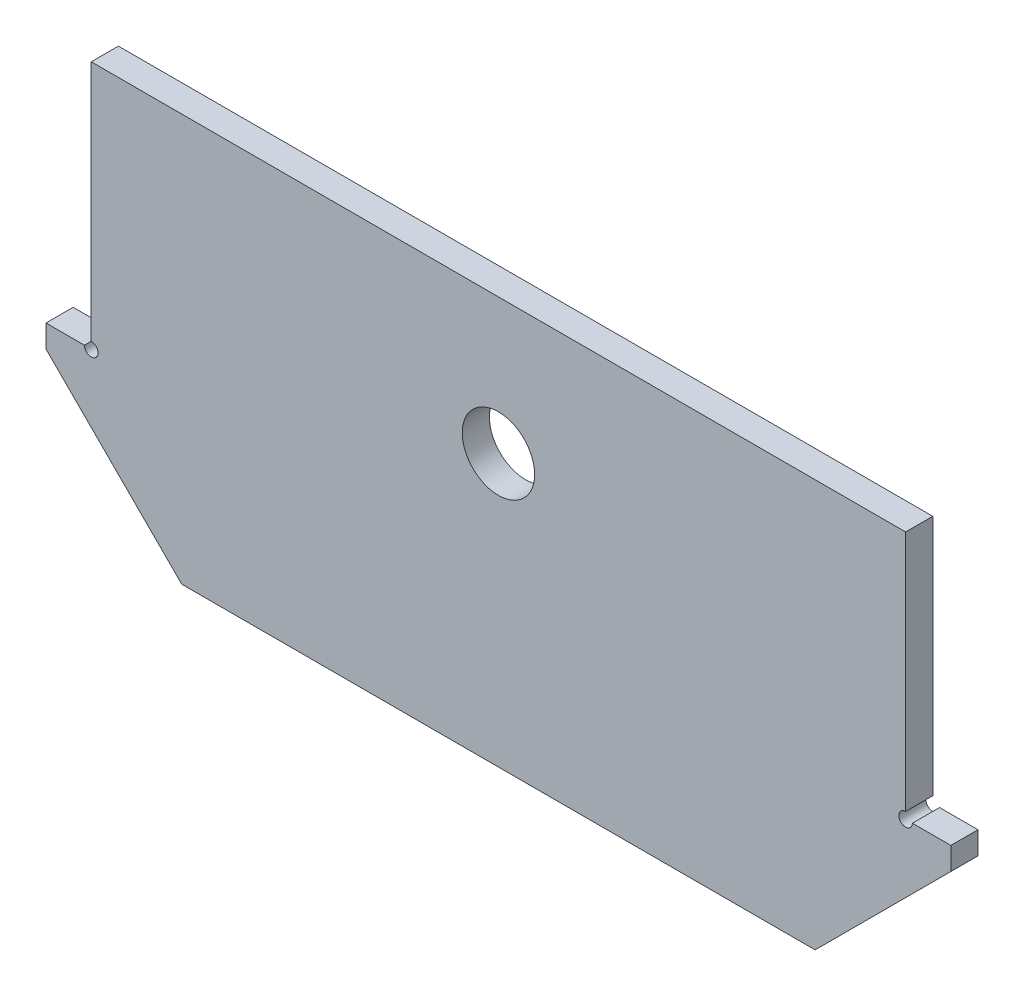
ISO-10303-21;
HEADER;
FILE_DESCRIPTION(('STEP AP214'),'2;1');
FILE_NAME('part.step','',(''),(''),'','','');
FILE_SCHEMA(('AUTOMOTIVE_DESIGN { 1 0 10303 214 1 1 1 1 }'));
ENDSEC;
DATA;
#1=APPLICATION_CONTEXT('core data for automotive mechanical design processes');
#2=APPLICATION_PROTOCOL_DEFINITION('international standard','automotive_design',2000,#1);
#3=PRODUCT_CONTEXT('',#1,'mechanical');
#4=PRODUCT('Part','Part','',(#3));
#5=PRODUCT_RELATED_PRODUCT_CATEGORY('part','',(#4));
#6=PRODUCT_DEFINITION_FORMATION('','',#4);
#7=PRODUCT_DEFINITION_CONTEXT('part definition',#1,'design');
#8=PRODUCT_DEFINITION('design','',#6,#7);
#9=PRODUCT_DEFINITION_SHAPE('','',#8);
#10=(LENGTH_UNIT() NAMED_UNIT(*) SI_UNIT(.MILLI.,.METRE.));
#11=(NAMED_UNIT(*) PLANE_ANGLE_UNIT() SI_UNIT($,.RADIAN.));
#12=(NAMED_UNIT(*) SI_UNIT($,.STERADIAN.) SOLID_ANGLE_UNIT());
#13=UNCERTAINTY_MEASURE_WITH_UNIT(LENGTH_MEASURE(1.E-05),#10,'distance_accuracy_value','');
#14=(GEOMETRIC_REPRESENTATION_CONTEXT(3) GLOBAL_UNCERTAINTY_ASSIGNED_CONTEXT((#13)) GLOBAL_UNIT_ASSIGNED_CONTEXT((#10,
#11,#12)) REPRESENTATION_CONTEXT('',''));
#15=CARTESIAN_POINT('',(0.,0.,0.));
#16=DIRECTION('',(0.,0.,1.));
#17=DIRECTION('',(1.,0.,0.));
#18=AXIS2_PLACEMENT_3D('',#15,#16,#17);
#19=CARTESIAN_POINT('',(-99.9999999999998,-1414.00000592193,-3.));
#20=DIRECTION('',(0.,1.,0.));
#21=DIRECTION('',(0.,0.,1.));
#22=AXIS2_PLACEMENT_3D('',#19,#20,#21);
#23=PLANE('',#22);
#24=DIRECTION('',(0.,0.,1.));
#25=VECTOR('',#24,1.);
#26=CARTESIAN_POINT('',(-91.4999999999999,-1414.00000592193,-3.));
#27=LINE('',#26,#25);
#28=CARTESIAN_POINT('',(-91.4999999999999,-1414.00000592193,-3.));
#29=VERTEX_POINT('',#28);
#30=CARTESIAN_POINT('',(-91.4999999999999,-1414.00000592193,3.));
#31=VERTEX_POINT('',#30);
#32=EDGE_CURVE('E54',#29,#31,#27,.T.);
#33=ORIENTED_EDGE('',*,*,#32,.F.);
#34=DIRECTION('',(-1.,0.,0.));
#35=VECTOR('',#34,1.);
#36=CARTESIAN_POINT('',(-99.9999999999998,-1414.00000592193,-3.));
#37=LINE('',#36,#35);
#38=CARTESIAN_POINT('',(-99.9999999999998,-1414.00000592193,-3.));
#39=VERTEX_POINT('',#38);
#40=EDGE_CURVE('E211',#29,#39,#37,.T.);
#41=ORIENTED_EDGE('',*,*,#40,.T.);
#42=DIRECTION('',(0.,0.,1.));
#43=VECTOR('',#42,1.);
#44=CARTESIAN_POINT('',(-99.9999999999998,-1414.00000592193,-3.));
#45=LINE('',#44,#43);
#46=CARTESIAN_POINT('',(-99.9999999999998,-1414.00000592193,3.));
#47=VERTEX_POINT('',#46);
#48=EDGE_CURVE('E154',#39,#47,#45,.T.);
#49=ORIENTED_EDGE('',*,*,#48,.T.);
#50=DIRECTION('',(-1.,0.,0.));
#51=VECTOR('',#50,1.);
#52=CARTESIAN_POINT('',(-99.9999999999998,-1414.00000592193,3.));
#53=LINE('',#52,#51);
#54=EDGE_CURVE('E173',#31,#47,#53,.T.);
#55=ORIENTED_EDGE('',*,*,#54,.F.);
#56=EDGE_LOOP('',(#33,#41,#49,#55));
#57=FACE_BOUND('',#56,.T.);
#58=ADVANCED_FACE('F33',(#57),#23,.T.);
#59=CARTESIAN_POINT('',(-90.,-1414.00000592193,-3.));
#60=DIRECTION('',(-1.,0.,0.));
#61=DIRECTION('',(0.,0.,1.));
#62=AXIS2_PLACEMENT_3D('',#59,#60,#61);
#63=PLANE('',#62);
#64=DIRECTION('',(0.,0.,1.));
#65=VECTOR('',#64,1.);
#66=CARTESIAN_POINT('',(-90.,-1412.50000592193,-3.));
#67=LINE('',#66,#65);
#68=CARTESIAN_POINT('',(-90.,-1412.50000592193,3.));
#69=VERTEX_POINT('',#68);
#70=CARTESIAN_POINT('',(-90.,-1412.50000592193,-3.));
#71=VERTEX_POINT('',#70);
#72=EDGE_CURVE('E183',#69,#71,#67,.F.);
#73=ORIENTED_EDGE('',*,*,#72,.F.);
#74=DIRECTION('',(0.,-1.,0.));
#75=VECTOR('',#74,1.);
#76=CARTESIAN_POINT('',(-90.,-1414.00000592193,3.));
#77=LINE('',#76,#75);
#78=CARTESIAN_POINT('',(-90.,-1359.00000592193,3.));
#79=VERTEX_POINT('',#78);
#80=EDGE_CURVE('E208',#79,#69,#77,.T.);
#81=ORIENTED_EDGE('',*,*,#80,.F.);
#82=DIRECTION('',(0.,0.,1.));
#83=VECTOR('',#82,1.);
#84=CARTESIAN_POINT('',(-90.,-1359.00000592193,-3.));
#85=LINE('',#84,#83);
#86=CARTESIAN_POINT('',(-90.,-1359.00000592193,-3.));
#87=VERTEX_POINT('',#86);
#88=EDGE_CURVE('E155',#87,#79,#85,.T.);
#89=ORIENTED_EDGE('',*,*,#88,.F.);
#90=DIRECTION('',(0.,-1.,0.));
#91=VECTOR('',#90,1.);
#92=CARTESIAN_POINT('',(-90.,-1414.00000592193,-3.));
#93=LINE('',#92,#91);
#94=EDGE_CURVE('E151',#87,#71,#93,.T.);
#95=ORIENTED_EDGE('',*,*,#94,.T.);
#96=EDGE_LOOP('',(#73,#81,#89,#95));
#97=FACE_BOUND('',#96,.T.);
#98=ADVANCED_FACE('F247',(#97),#63,.T.);
#99=CARTESIAN_POINT('',(-90.,-1359.00000592193,-3.));
#100=DIRECTION('',(0.,1.,0.));
#101=DIRECTION('',(0.,0.,1.));
#102=AXIS2_PLACEMENT_3D('',#99,#100,#101);
#103=PLANE('',#102);
#104=ORIENTED_EDGE('',*,*,#88,.T.);
#105=DIRECTION('',(-1.,0.,0.));
#106=VECTOR('',#105,1.);
#107=CARTESIAN_POINT('',(-90.,-1359.00000592193,3.));
#108=LINE('',#107,#106);
#109=CARTESIAN_POINT('',(90.0000000000003,-1359.00000592193,3.));
#110=VERTEX_POINT('',#109);
#111=EDGE_CURVE('E205',#110,#79,#108,.T.);
#112=ORIENTED_EDGE('',*,*,#111,.F.);
#113=DIRECTION('',(0.,0.,1.));
#114=VECTOR('',#113,1.);
#115=CARTESIAN_POINT('',(90.0000000000003,-1359.00000592193,-3.));
#116=LINE('',#115,#114);
#117=CARTESIAN_POINT('',(90.0000000000003,-1359.00000592193,-3.));
#118=VERTEX_POINT('',#117);
#119=EDGE_CURVE('E157',#118,#110,#116,.T.);
#120=ORIENTED_EDGE('',*,*,#119,.F.);
#121=DIRECTION('',(-1.,0.,0.));
#122=VECTOR('',#121,1.);
#123=CARTESIAN_POINT('',(-90.,-1359.00000592193,-3.));
#124=LINE('',#123,#122);
#125=EDGE_CURVE('E143',#118,#87,#124,.T.);
#126=ORIENTED_EDGE('',*,*,#125,.T.);
#127=EDGE_LOOP('',(#104,#112,#120,#126));
#128=FACE_BOUND('',#127,.T.);
#129=ADVANCED_FACE('F251',(#128),#103,.T.);
#130=CARTESIAN_POINT('',(90.0000000000003,-1414.00000592193,-3.));
#131=DIRECTION('',(1.,0.,0.));
#132=DIRECTION('',(0.,0.,-1.));
#133=AXIS2_PLACEMENT_3D('',#130,#131,#132);
#134=PLANE('',#133);
#135=DIRECTION('',(0.,0.,1.));
#136=VECTOR('',#135,1.);
#137=CARTESIAN_POINT('',(90.0000000000003,-1412.50000592193,-3.));
#138=LINE('',#137,#136);
#139=CARTESIAN_POINT('',(90.0000000000003,-1412.50000592193,-3.));
#140=VERTEX_POINT('',#139);
#141=CARTESIAN_POINT('',(90.0000000000003,-1412.50000592193,3.));
#142=VERTEX_POINT('',#141);
#143=EDGE_CURVE('E47',#140,#142,#138,.T.);
#144=ORIENTED_EDGE('',*,*,#143,.F.);
#145=DIRECTION('',(0.,1.,0.));
#146=VECTOR('',#145,1.);
#147=CARTESIAN_POINT('',(90.0000000000003,-1414.00000592193,-3.));
#148=LINE('',#147,#146);
#149=EDGE_CURVE('E137',#140,#118,#148,.T.);
#150=ORIENTED_EDGE('',*,*,#149,.T.);
#151=ORIENTED_EDGE('',*,*,#119,.T.);
#152=DIRECTION('',(0.,1.,0.));
#153=VECTOR('',#152,1.);
#154=CARTESIAN_POINT('',(90.0000000000003,-1414.00000592193,3.));
#155=LINE('',#154,#153);
#156=EDGE_CURVE('E203',#142,#110,#155,.T.);
#157=ORIENTED_EDGE('',*,*,#156,.F.);
#158=EDGE_LOOP('',(#144,#150,#151,#157));
#159=FACE_BOUND('',#158,.T.);
#160=ADVANCED_FACE('F257',(#159),#134,.T.);
#161=CARTESIAN_POINT('',(90.0000000000003,-1414.00000592193,-3.));
#162=DIRECTION('',(0.,1.,0.));
#163=DIRECTION('',(0.,0.,1.));
#164=AXIS2_PLACEMENT_3D('',#161,#162,#163);
#165=PLANE('',#164);
#166=DIRECTION('',(0.,0.,1.));
#167=VECTOR('',#166,1.);
#168=CARTESIAN_POINT('',(91.5000000000002,-1414.00000592193,-3.));
#169=LINE('',#168,#167);
#170=CARTESIAN_POINT('',(91.5000000000002,-1414.00000592193,3.));
#171=VERTEX_POINT('',#170);
#172=CARTESIAN_POINT('',(91.5000000000002,-1414.00000592193,-3.));
#173=VERTEX_POINT('',#172);
#174=EDGE_CURVE('E118',#171,#173,#169,.F.);
#175=ORIENTED_EDGE('',*,*,#174,.F.);
#176=DIRECTION('',(-1.,0.,0.));
#177=VECTOR('',#176,1.);
#178=CARTESIAN_POINT('',(90.0000000000003,-1414.00000592193,3.));
#179=LINE('',#178,#177);
#180=CARTESIAN_POINT('',(100.,-1414.00000592193,3.));
#181=VERTEX_POINT('',#180);
#182=EDGE_CURVE('E201',#181,#171,#179,.T.);
#183=ORIENTED_EDGE('',*,*,#182,.F.);
#184=DIRECTION('',(0.,0.,1.));
#185=VECTOR('',#184,1.);
#186=CARTESIAN_POINT('',(100.,-1414.00000592193,-3.));
#187=LINE('',#186,#185);
#188=CARTESIAN_POINT('',(100.,-1414.00000592193,-3.));
#189=VERTEX_POINT('',#188);
#190=EDGE_CURVE('E140',#189,#181,#187,.T.);
#191=ORIENTED_EDGE('',*,*,#190,.F.);
#192=DIRECTION('',(-1.,0.,0.));
#193=VECTOR('',#192,1.);
#194=CARTESIAN_POINT('',(90.0000000000003,-1414.00000592193,-3.));
#195=LINE('',#194,#193);
#196=EDGE_CURVE('E134',#189,#173,#195,.T.);
#197=ORIENTED_EDGE('',*,*,#196,.T.);
#198=EDGE_LOOP('',(#175,#183,#191,#197));
#199=FACE_BOUND('',#198,.T.);
#200=ADVANCED_FACE('F139',(#199),#165,.T.);
#201=CARTESIAN_POINT('',(100.,-1414.00000592193,-3.));
#202=DIRECTION('',(1.,0.,0.));
#203=DIRECTION('',(0.,1.,0.));
#204=AXIS2_PLACEMENT_3D('',#201,#202,#203);
#205=PLANE('',#204);
#206=ORIENTED_EDGE('',*,*,#190,.T.);
#207=DIRECTION('',(0.,1.,0.));
#208=VECTOR('',#207,1.);
#209=CARTESIAN_POINT('',(100.,-1414.00000592193,3.));
#210=LINE('',#209,#208);
#211=CARTESIAN_POINT('',(100.,-1419.00000592193,3.));
#212=VERTEX_POINT('',#211);
#213=EDGE_CURVE('E198',#212,#181,#210,.T.);
#214=ORIENTED_EDGE('',*,*,#213,.F.);
#215=DIRECTION('',(0.,0.,1.));
#216=VECTOR('',#215,1.);
#217=CARTESIAN_POINT('',(100.,-1419.00000592193,-3.));
#218=LINE('',#217,#216);
#219=CARTESIAN_POINT('',(100.,-1419.00000592193,-3.));
#220=VERTEX_POINT('',#219);
#221=EDGE_CURVE('E161',#220,#212,#218,.T.);
#222=ORIENTED_EDGE('',*,*,#221,.F.);
#223=DIRECTION('',(0.,1.,0.));
#224=VECTOR('',#223,1.);
#225=CARTESIAN_POINT('',(100.,-1414.00000592193,-3.));
#226=LINE('',#225,#224);
#227=EDGE_CURVE('E141',#220,#189,#226,.T.);
#228=ORIENTED_EDGE('',*,*,#227,.T.);
#229=EDGE_LOOP('',(#206,#214,#222,#228));
#230=FACE_BOUND('',#229,.T.);
#231=ADVANCED_FACE('F269',(#230),#205,.T.);
#232=CARTESIAN_POINT('',(70.0000000000002,-1449.00000592193,-3.));
#233=DIRECTION('',(0.707106781186545,-0.70710678118655,0.));
#234=DIRECTION('',(0.70710678118655,0.707106781186545,0.));
#235=AXIS2_PLACEMENT_3D('',#232,#233,#234);
#236=PLANE('',#235);
#237=ORIENTED_EDGE('',*,*,#221,.T.);
#238=DIRECTION('',(0.70710678118655,0.707106781186545,0.));
#239=VECTOR('',#238,1.);
#240=CARTESIAN_POINT('',(70.0000000000002,-1449.00000592193,3.));
#241=LINE('',#240,#239);
#242=CARTESIAN_POINT('',(70.0000000000002,-1449.00000592193,3.));
#243=VERTEX_POINT('',#242);
#244=EDGE_CURVE('E195',#243,#212,#241,.T.);
#245=ORIENTED_EDGE('',*,*,#244,.F.);
#246=DIRECTION('',(0.,0.,1.));
#247=VECTOR('',#246,1.);
#248=CARTESIAN_POINT('',(70.0000000000002,-1449.00000592193,-3.));
#249=LINE('',#248,#247);
#250=CARTESIAN_POINT('',(70.0000000000002,-1449.00000592193,-3.));
#251=VERTEX_POINT('',#250);
#252=EDGE_CURVE('E163',#251,#243,#249,.T.);
#253=ORIENTED_EDGE('',*,*,#252,.F.);
#254=DIRECTION('',(0.70710678118655,0.707106781186545,0.));
#255=VECTOR('',#254,1.);
#256=CARTESIAN_POINT('',(70.0000000000002,-1449.00000592193,-3.));
#257=LINE('',#256,#255);
#258=EDGE_CURVE('E145',#251,#220,#257,.T.);
#259=ORIENTED_EDGE('',*,*,#258,.T.);
#260=EDGE_LOOP('',(#237,#245,#253,#259));
#261=FACE_BOUND('',#260,.T.);
#262=ADVANCED_FACE('F224',(#261),#236,.T.);
#263=CARTESIAN_POINT('',(-69.9999999999998,-1449.00000592193,-3.));
#264=DIRECTION('',(0.,-1.,0.));
#265=DIRECTION('',(1.,0.,0.));
#266=AXIS2_PLACEMENT_3D('',#263,#264,#265);
#267=PLANE('',#266);
#268=ORIENTED_EDGE('',*,*,#252,.T.);
#269=DIRECTION('',(1.,0.,0.));
#270=VECTOR('',#269,1.);
#271=CARTESIAN_POINT('',(-69.9999999999998,-1449.00000592193,3.));
#272=LINE('',#271,#270);
#273=CARTESIAN_POINT('',(-69.9999999999998,-1449.00000592193,3.));
#274=VERTEX_POINT('',#273);
#275=EDGE_CURVE('E192',#274,#243,#272,.T.);
#276=ORIENTED_EDGE('',*,*,#275,.F.);
#277=DIRECTION('',(0.,0.,1.));
#278=VECTOR('',#277,1.);
#279=CARTESIAN_POINT('',(-69.9999999999998,-1449.00000592193,-3.));
#280=LINE('',#279,#278);
#281=CARTESIAN_POINT('',(-69.9999999999998,-1449.00000592193,-3.));
#282=VERTEX_POINT('',#281);
#283=EDGE_CURVE('E165',#282,#274,#280,.T.);
#284=ORIENTED_EDGE('',*,*,#283,.F.);
#285=DIRECTION('',(1.,0.,0.));
#286=VECTOR('',#285,1.);
#287=CARTESIAN_POINT('',(-69.9999999999998,-1449.00000592193,-3.));
#288=LINE('',#287,#286);
#289=EDGE_CURVE('E219',#282,#251,#288,.T.);
#290=ORIENTED_EDGE('',*,*,#289,.T.);
#291=EDGE_LOOP('',(#268,#276,#284,#290));
#292=FACE_BOUND('',#291,.T.);
#293=ADVANCED_FACE('F229',(#292),#267,.T.);
#294=CARTESIAN_POINT('',(-99.9999999999999,-1419.00000592193,-3.));
#295=DIRECTION('',(-0.707106781186548,-0.707106781186547,0.));
#296=DIRECTION('',(0.707106781186547,-0.707106781186548,0.));
#297=AXIS2_PLACEMENT_3D('',#294,#295,#296);
#298=PLANE('',#297);
#299=ORIENTED_EDGE('',*,*,#283,.T.);
#300=DIRECTION('',(0.707106781186547,-0.707106781186548,0.));
#301=VECTOR('',#300,1.);
#302=CARTESIAN_POINT('',(-99.9999999999999,-1419.00000592193,3.));
#303=LINE('',#302,#301);
#304=CARTESIAN_POINT('',(-99.9999999999999,-1419.00000592193,3.));
#305=VERTEX_POINT('',#304);
#306=EDGE_CURVE('E189',#305,#274,#303,.T.);
#307=ORIENTED_EDGE('',*,*,#306,.F.);
#308=DIRECTION('',(0.,0.,1.));
#309=VECTOR('',#308,1.);
#310=CARTESIAN_POINT('',(-99.9999999999999,-1419.00000592193,-3.));
#311=LINE('',#310,#309);
#312=CARTESIAN_POINT('',(-99.9999999999999,-1419.00000592193,-3.));
#313=VERTEX_POINT('',#312);
#314=EDGE_CURVE('E167',#313,#305,#311,.T.);
#315=ORIENTED_EDGE('',*,*,#314,.F.);
#316=DIRECTION('',(0.707106781186547,-0.707106781186548,0.));
#317=VECTOR('',#316,1.);
#318=CARTESIAN_POINT('',(-99.9999999999999,-1419.00000592193,-3.));
#319=LINE('',#318,#317);
#320=EDGE_CURVE('E216',#313,#282,#319,.T.);
#321=ORIENTED_EDGE('',*,*,#320,.T.);
#322=EDGE_LOOP('',(#299,#307,#315,#321));
#323=FACE_BOUND('',#322,.T.);
#324=ADVANCED_FACE('F233',(#323),#298,.T.);
#325=CARTESIAN_POINT('',(-99.9999999999998,-1414.00000592193,-3.));
#326=DIRECTION('',(-1.,0.,0.));
#327=DIRECTION('',(0.,-1.,0.));
#328=AXIS2_PLACEMENT_3D('',#325,#326,#327);
#329=PLANE('',#328);
#330=ORIENTED_EDGE('',*,*,#314,.T.);
#331=DIRECTION('',(0.,-1.,0.));
#332=VECTOR('',#331,1.);
#333=CARTESIAN_POINT('',(-99.9999999999998,-1414.00000592193,3.));
#334=LINE('',#333,#332);
#335=EDGE_CURVE('E177',#47,#305,#334,.T.);
#336=ORIENTED_EDGE('',*,*,#335,.F.);
#337=ORIENTED_EDGE('',*,*,#48,.F.);
#338=DIRECTION('',(0.,-1.,0.));
#339=VECTOR('',#338,1.);
#340=CARTESIAN_POINT('',(-99.9999999999998,-1414.00000592193,-3.));
#341=LINE('',#340,#339);
#342=EDGE_CURVE('E213',#39,#313,#341,.T.);
#343=ORIENTED_EDGE('',*,*,#342,.T.);
#344=EDGE_LOOP('',(#330,#336,#337,#343));
#345=FACE_BOUND('',#344,.T.);
#346=ADVANCED_FACE('F241',(#345),#329,.T.);
#347=CARTESIAN_POINT('',(0.,0.,-3.));
#348=DIRECTION('',(0.,0.,1.));
#349=DIRECTION('',(1.,0.,0.));
#350=AXIS2_PLACEMENT_3D('',#347,#348,#349);
#351=PLANE('',#350);
#352=CARTESIAN_POINT('',(-4.09517106812903E-13,-1389.00000592193,-3.));
#353=DIRECTION('',(0.,0.,1.));
#354=DIRECTION('',(1.,0.,0.));
#355=AXIS2_PLACEMENT_3D('',#352,#353,#354);
#356=CIRCLE('',#355,8.00000000000001);
#357=CARTESIAN_POINT('',(7.9999999999996,-1389.00000592193,-3.));
#358=VERTEX_POINT('',#357);
#359=EDGE_CURVE('E174',#358,#358,#356,.T.);
#360=ORIENTED_EDGE('',*,*,#359,.T.);
#361=EDGE_LOOP('',(#360));
#362=FACE_BOUND('',#361,.T.);
#363=ORIENTED_EDGE('',*,*,#40,.F.);
#364=CARTESIAN_POINT('',(-90.,-1414.00000592193,-3.));
#365=DIRECTION('',(0.,0.,1.));
#366=DIRECTION('',(1.,0.,0.));
#367=AXIS2_PLACEMENT_3D('',#364,#365,#366);
#368=CIRCLE('',#367,1.4999999999999);
#369=EDGE_CURVE('E126',#29,#71,#368,.T.);
#370=ORIENTED_EDGE('',*,*,#369,.T.);
#371=ORIENTED_EDGE('',*,*,#94,.F.);
#372=ORIENTED_EDGE('',*,*,#125,.F.);
#373=ORIENTED_EDGE('',*,*,#149,.F.);
#374=CARTESIAN_POINT('',(90.0000000000003,-1414.00000592193,-3.));
#375=DIRECTION('',(0.,0.,1.));
#376=DIRECTION('',(1.,0.,0.));
#377=AXIS2_PLACEMENT_3D('',#374,#375,#376);
#378=CIRCLE('',#377,1.4999999999999);
#379=EDGE_CURVE('E121',#140,#173,#378,.T.);
#380=ORIENTED_EDGE('',*,*,#379,.T.);
#381=ORIENTED_EDGE('',*,*,#196,.F.);
#382=ORIENTED_EDGE('',*,*,#227,.F.);
#383=ORIENTED_EDGE('',*,*,#258,.F.);
#384=ORIENTED_EDGE('',*,*,#289,.F.);
#385=ORIENTED_EDGE('',*,*,#320,.F.);
#386=ORIENTED_EDGE('',*,*,#342,.F.);
#387=EDGE_LOOP('',(#363,#370,#371,#372,#373,#380,#381,#382,#383,#384,#385,#386));
#388=FACE_BOUND('',#387,.T.);
#389=ADVANCED_FACE('F132',(#362,#388),#351,.F.);
#390=CARTESIAN_POINT('',(0.,0.,3.));
#391=DIRECTION('',(0.,0.,1.));
#392=DIRECTION('',(1.,0.,0.));
#393=AXIS2_PLACEMENT_3D('',#390,#391,#392);
#394=PLANE('',#393);
#395=CARTESIAN_POINT('',(-90.,-1414.00000592193,3.));
#396=DIRECTION('',(0.,0.,1.));
#397=DIRECTION('',(1.,0.,0.));
#398=AXIS2_PLACEMENT_3D('',#395,#396,#397);
#399=CIRCLE('',#398,1.4999999999999);
#400=EDGE_CURVE('E11',#31,#69,#399,.T.);
#401=ORIENTED_EDGE('',*,*,#400,.F.);
#402=ORIENTED_EDGE('',*,*,#54,.T.);
#403=ORIENTED_EDGE('',*,*,#335,.T.);
#404=ORIENTED_EDGE('',*,*,#306,.T.);
#405=ORIENTED_EDGE('',*,*,#275,.T.);
#406=ORIENTED_EDGE('',*,*,#244,.T.);
#407=ORIENTED_EDGE('',*,*,#213,.T.);
#408=ORIENTED_EDGE('',*,*,#182,.T.);
#409=CARTESIAN_POINT('',(90.0000000000003,-1414.00000592193,3.));
#410=DIRECTION('',(0.,0.,1.));
#411=DIRECTION('',(1.,0.,0.));
#412=AXIS2_PLACEMENT_3D('',#409,#410,#411);
#413=CIRCLE('',#412,1.4999999999999);
#414=EDGE_CURVE('E40',#142,#171,#413,.T.);
#415=ORIENTED_EDGE('',*,*,#414,.F.);
#416=ORIENTED_EDGE('',*,*,#156,.T.);
#417=ORIENTED_EDGE('',*,*,#111,.T.);
#418=ORIENTED_EDGE('',*,*,#80,.T.);
#419=EDGE_LOOP('',(#401,#402,#403,#404,#405,#406,#407,#408,#415,#416,#417,#418));
#420=FACE_BOUND('',#419,.T.);
#421=CARTESIAN_POINT('',(-4.09517106812903E-13,-1389.00000592193,3.));
#422=DIRECTION('',(0.,0.,1.));
#423=DIRECTION('',(1.,0.,0.));
#424=AXIS2_PLACEMENT_3D('',#421,#422,#423);
#425=CIRCLE('',#424,8.00000000000001);
#426=CARTESIAN_POINT('',(7.9999999999996,-1389.00000592193,3.));
#427=VERTEX_POINT('',#426);
#428=EDGE_CURVE('E171',#427,#427,#425,.T.);
#429=ORIENTED_EDGE('',*,*,#428,.F.);
#430=EDGE_LOOP('',(#429));
#431=FACE_BOUND('',#430,.T.);
#432=ADVANCED_FACE('F235',(#420,#431),#394,.T.);
#433=CARTESIAN_POINT('',(-4.09517106812903E-13,-1389.00000592193,-3.));
#434=DIRECTION('',(0.,0.,1.));
#435=DIRECTION('',(1.,0.,0.));
#436=AXIS2_PLACEMENT_3D('',#433,#434,#435);
#437=CYLINDRICAL_SURFACE('',#436,8.00000000000001);
#438=ORIENTED_EDGE('',*,*,#428,.T.);
#439=EDGE_LOOP('',(#438));
#440=FACE_BOUND('',#439,.T.);
#441=ORIENTED_EDGE('',*,*,#359,.F.);
#442=EDGE_LOOP('',(#441));
#443=FACE_BOUND('',#442,.T.);
#444=ADVANCED_FACE('F285',(#440,#443),#437,.F.);
#445=CARTESIAN_POINT('',(90.0000000000003,-1414.00000592193,-3.));
#446=DIRECTION('',(0.,0.,1.));
#447=DIRECTION('',(1.,0.,0.));
#448=AXIS2_PLACEMENT_3D('',#445,#446,#447);
#449=CYLINDRICAL_SURFACE('',#448,1.4999999999999);
#450=ORIENTED_EDGE('',*,*,#143,.T.);
#451=ORIENTED_EDGE('',*,*,#414,.T.);
#452=ORIENTED_EDGE('',*,*,#174,.T.);
#453=ORIENTED_EDGE('',*,*,#379,.F.);
#454=EDGE_LOOP('',(#450,#451,#452,#453));
#455=FACE_BOUND('',#454,.T.);
#456=ADVANCED_FACE('F120',(#455),#449,.F.);
#457=CARTESIAN_POINT('',(-90.,-1414.00000592193,-3.));
#458=DIRECTION('',(0.,0.,1.));
#459=DIRECTION('',(1.,0.,0.));
#460=AXIS2_PLACEMENT_3D('',#457,#458,#459);
#461=CYLINDRICAL_SURFACE('',#460,1.4999999999999);
#462=ORIENTED_EDGE('',*,*,#32,.T.);
#463=ORIENTED_EDGE('',*,*,#400,.T.);
#464=ORIENTED_EDGE('',*,*,#72,.T.);
#465=ORIENTED_EDGE('',*,*,#369,.F.);
#466=EDGE_LOOP('',(#462,#463,#464,#465));
#467=FACE_BOUND('',#466,.T.);
#468=ADVANCED_FACE('F293',(#467),#461,.F.);
#469=CLOSED_SHELL('',(#58,#98,#129,#160,#200,#231,#262,#293,#324,#346,#389,#432,#444,#456,#468));
#470=MANIFOLD_SOLID_BREP('B2',#469);
#471=ADVANCED_BREP_SHAPE_REPRESENTATION('',(#18,#470),#14);
#472=SHAPE_DEFINITION_REPRESENTATION(#9,#471);
ENDSEC;
END-ISO-10303-21;
